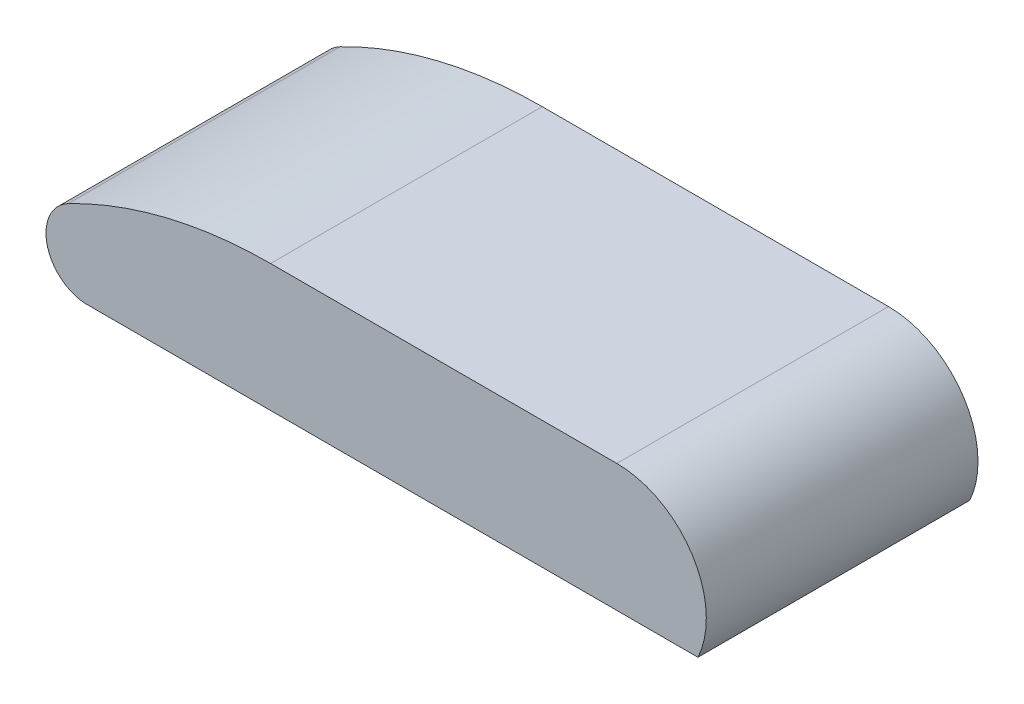
ISO-10303-21;
HEADER;
FILE_DESCRIPTION(('STEP AP214'),'2;1');
FILE_NAME('part.step','',(''),(''),'','','');
FILE_SCHEMA(('AUTOMOTIVE_DESIGN { 1 0 10303 214 1 1 1 1 }'));
ENDSEC;
DATA;
#1=APPLICATION_CONTEXT('core data for automotive mechanical design processes');
#2=APPLICATION_PROTOCOL_DEFINITION('international standard','automotive_design',2000,#1);
#3=PRODUCT_CONTEXT('',#1,'mechanical');
#4=PRODUCT('Part','Part','',(#3));
#5=PRODUCT_RELATED_PRODUCT_CATEGORY('part','',(#4));
#6=PRODUCT_DEFINITION_FORMATION('','',#4);
#7=PRODUCT_DEFINITION_CONTEXT('part definition',#1,'design');
#8=PRODUCT_DEFINITION('design','',#6,#7);
#9=PRODUCT_DEFINITION_SHAPE('','',#8);
#10=(LENGTH_UNIT() NAMED_UNIT(*) SI_UNIT(.MILLI.,.METRE.));
#11=(NAMED_UNIT(*) PLANE_ANGLE_UNIT() SI_UNIT($,.RADIAN.));
#12=(NAMED_UNIT(*) SI_UNIT($,.STERADIAN.) SOLID_ANGLE_UNIT());
#13=UNCERTAINTY_MEASURE_WITH_UNIT(LENGTH_MEASURE(1.E-05),#10,'distance_accuracy_value','');
#14=(GEOMETRIC_REPRESENTATION_CONTEXT(3) GLOBAL_UNCERTAINTY_ASSIGNED_CONTEXT((#13)) GLOBAL_UNIT_ASSIGNED_CONTEXT((#10,
#11,#12)) REPRESENTATION_CONTEXT('',''));
#15=CARTESIAN_POINT('',(0.,0.,0.));
#16=DIRECTION('',(0.,0.,1.));
#17=DIRECTION('',(1.,0.,0.));
#18=AXIS2_PLACEMENT_3D('',#15,#16,#17);
#19=CARTESIAN_POINT('',(0.,14.5,38.));
#20=DIRECTION('',(0.,-1.,0.));
#21=DIRECTION('',(1.,0.,0.));
#22=AXIS2_PLACEMENT_3D('',#19,#20,#21);
#23=PLANE('',#22);
#24=DIRECTION('',(0.,0.,-1.));
#25=VECTOR('',#24,1.);
#26=CARTESIAN_POINT('',(66.5200000000003,14.5,38.));
#27=LINE('',#26,#25);
#28=CARTESIAN_POINT('',(66.5200000000003,14.5,39.));
#29=VERTEX_POINT('',#28);
#30=CARTESIAN_POINT('',(66.5200000000003,14.5,-1.));
#31=VERTEX_POINT('',#30);
#32=EDGE_CURVE('E254',#29,#31,#27,.T.);
#33=ORIENTED_EDGE('',*,*,#32,.T.);
#34=DIRECTION('',(1.,0.,0.));
#35=VECTOR('',#34,1.);
#36=CARTESIAN_POINT('',(15.5400000000003,14.5,-1.));
#37=LINE('',#36,#35);
#38=CARTESIAN_POINT('',(15.5400000000003,14.5,-1.));
#39=VERTEX_POINT('',#38);
#40=EDGE_CURVE('E218',#39,#31,#37,.T.);
#41=ORIENTED_EDGE('',*,*,#40,.F.);
#42=DIRECTION('',(0.,0.,-1.));
#43=VECTOR('',#42,1.);
#44=CARTESIAN_POINT('',(15.5400000000003,14.5,38.));
#45=LINE('',#44,#43);
#46=CARTESIAN_POINT('',(15.5400000000003,14.5,39.));
#47=VERTEX_POINT('',#46);
#48=EDGE_CURVE('E305',#47,#39,#45,.T.);
#49=ORIENTED_EDGE('',*,*,#48,.F.);
#50=DIRECTION('',(1.,0.,0.));
#51=VECTOR('',#50,1.);
#52=CARTESIAN_POINT('',(15.5400000000003,14.5,39.));
#53=LINE('',#52,#51);
#54=EDGE_CURVE('E209',#47,#29,#53,.T.);
#55=ORIENTED_EDGE('',*,*,#54,.T.);
#56=EDGE_LOOP('',(#33,#41,#49,#55));
#57=FACE_BOUND('',#56,.T.);
#58=ADVANCED_FACE('F33',(#57),#23,.F.);
#59=CARTESIAN_POINT('',(15.5400000000003,-50.2795958789134,38.));
#60=DIRECTION('',(0.,0.,-1.));
#61=DIRECTION('',(-1.,0.,0.));
#62=AXIS2_PLACEMENT_3D('',#59,#60,#61);
#63=CYLINDRICAL_SURFACE('',#62,64.7795958789135);
#64=ORIENTED_EDGE('',*,*,#48,.T.);
#65=CARTESIAN_POINT('',(15.5400000000003,-50.2795958789134,-1.));
#66=DIRECTION('',(0.,0.,-1.));
#67=DIRECTION('',(-1.,0.,0.));
#68=AXIS2_PLACEMENT_3D('',#65,#66,#67);
#69=CIRCLE('',#68,64.7795958789135);
#70=CARTESIAN_POINT('',(-14.2250375276555,7.25681505549044,-1.));
#71=VERTEX_POINT('',#70);
#72=EDGE_CURVE('E215',#71,#39,#69,.T.);
#73=ORIENTED_EDGE('',*,*,#72,.F.);
#74=DIRECTION('',(0.,0.,-1.));
#75=VECTOR('',#74,1.);
#76=CARTESIAN_POINT('',(-14.2250375276555,7.25681505549044,38.));
#77=LINE('',#76,#75);
#78=CARTESIAN_POINT('',(-14.2250375276555,7.25681505549044,39.));
#79=VERTEX_POINT('',#78);
#80=EDGE_CURVE('E303',#79,#71,#77,.T.);
#81=ORIENTED_EDGE('',*,*,#80,.F.);
#82=CARTESIAN_POINT('',(15.5400000000003,-50.2795958789134,39.));
#83=DIRECTION('',(0.,0.,-1.));
#84=DIRECTION('',(-1.,0.,0.));
#85=AXIS2_PLACEMENT_3D('',#82,#83,#84);
#86=CIRCLE('',#85,64.7795958789135);
#87=EDGE_CURVE('E200',#79,#47,#86,.T.);
#88=ORIENTED_EDGE('',*,*,#87,.T.);
#89=EDGE_LOOP('',(#64,#73,#81,#88));
#90=FACE_BOUND('',#89,.T.);
#91=ADVANCED_FACE('F353',(#90),#63,.T.);
#92=CARTESIAN_POINT('',(-11.426599769246,1.84737907905001,38.));
#93=DIRECTION('',(0.,0.,-1.));
#94=DIRECTION('',(-1.,0.,0.));
#95=AXIS2_PLACEMENT_3D('',#92,#93,#94);
#96=CYLINDRICAL_SURFACE('',#95,6.09042293038011);
#97=ORIENTED_EDGE('',*,*,#80,.T.);
#98=CARTESIAN_POINT('',(-11.426599769246,1.84737907905001,-1.));
#99=DIRECTION('',(0.,0.,-1.));
#100=DIRECTION('',(-1.,0.,0.));
#101=AXIS2_PLACEMENT_3D('',#98,#99,#100);
#102=CIRCLE('',#101,6.09042293038011);
#103=CARTESIAN_POINT('',(-11.7115140980292,-4.23637595350628,-1.));
#104=VERTEX_POINT('',#103);
#105=EDGE_CURVE('E224',#104,#71,#102,.T.);
#106=ORIENTED_EDGE('',*,*,#105,.F.);
#107=DIRECTION('',(0.,0.,-1.));
#108=VECTOR('',#107,1.);
#109=CARTESIAN_POINT('',(-11.7115140980292,-4.23637595350628,38.));
#110=LINE('',#109,#108);
#111=CARTESIAN_POINT('',(-11.7115140980292,-4.23637595350613,39.));
#112=VERTEX_POINT('',#111);
#113=EDGE_CURVE('E300',#112,#104,#110,.T.);
#114=ORIENTED_EDGE('',*,*,#113,.F.);
#115=CARTESIAN_POINT('',(-11.426599769246,1.84737907905001,39.));
#116=DIRECTION('',(0.,0.,-1.));
#117=DIRECTION('',(-1.,0.,0.));
#118=AXIS2_PLACEMENT_3D('',#115,#116,#117);
#119=CIRCLE('',#118,6.09042293038011);
#120=EDGE_CURVE('E203',#112,#79,#119,.T.);
#121=ORIENTED_EDGE('',*,*,#120,.T.);
#122=EDGE_LOOP('',(#97,#106,#114,#121));
#123=FACE_BOUND('',#122,.T.);
#124=ADVANCED_FACE('F348',(#123),#96,.T.);
#125=CARTESIAN_POINT('',(66.5200000000003,1.31995191292337,38.));
#126=DIRECTION('',(0.,0.,-1.));
#127=DIRECTION('',(-1.,0.,0.));
#128=AXIS2_PLACEMENT_3D('',#125,#126,#127);
#129=CYLINDRICAL_SURFACE('',#128,13.1800480870766);
#130=DIRECTION('',(0.,0.,-1.));
#131=VECTOR('',#130,1.);
#132=CARTESIAN_POINT('',(78.4684108324822,-4.24324376545071,38.));
#133=LINE('',#132,#131);
#134=CARTESIAN_POINT('',(78.4684108324822,-4.2432437654507,39.));
#135=VERTEX_POINT('',#134);
#136=CARTESIAN_POINT('',(78.4684108324822,-4.2432437654507,-1.));
#137=VERTEX_POINT('',#136);
#138=EDGE_CURVE('E276',#135,#137,#133,.T.);
#139=ORIENTED_EDGE('',*,*,#138,.T.);
#140=CARTESIAN_POINT('',(66.5200000000003,1.31995191292337,-1.));
#141=DIRECTION('',(0.,0.,-1.));
#142=DIRECTION('',(-1.,0.,0.));
#143=AXIS2_PLACEMENT_3D('',#140,#141,#142);
#144=CIRCLE('',#143,13.1800480870767);
#145=EDGE_CURVE('E221',#31,#137,#144,.T.);
#146=ORIENTED_EDGE('',*,*,#145,.F.);
#147=ORIENTED_EDGE('',*,*,#32,.F.);
#148=CARTESIAN_POINT('',(66.5200000000003,1.31995191292337,39.));
#149=DIRECTION('',(0.,0.,-1.));
#150=DIRECTION('',(-1.,0.,0.));
#151=AXIS2_PLACEMENT_3D('',#148,#149,#150);
#152=CIRCLE('',#151,13.1800480870767);
#153=EDGE_CURVE('E206',#29,#135,#152,.T.);
#154=ORIENTED_EDGE('',*,*,#153,.T.);
#155=EDGE_LOOP('',(#139,#146,#147,#154));
#156=FACE_BOUND('',#155,.T.);
#157=ADVANCED_FACE('F360',(#156),#129,.T.);
#158=CARTESIAN_POINT('',(15.5400000000003,-50.2795958789134,-1.));
#159=DIRECTION('',(0.,0.,-1.));
#160=DIRECTION('',(-1.,0.,0.));
#161=AXIS2_PLACEMENT_3D('',#158,#159,#160);
#162=PLANE('',#161);
#163=ORIENTED_EDGE('',*,*,#145,.T.);
#164=DIRECTION('',(-0.999999997100073,7.61567713651417E-05,0.));
#165=VECTOR('',#164,1.);
#166=CARTESIAN_POINT('',(15.5435063449081,-4.23845160787258,-1.));
#167=LINE('',#166,#165);
#168=EDGE_CURVE('E11',#137,#104,#167,.T.);
#169=ORIENTED_EDGE('',*,*,#168,.T.);
#170=ORIENTED_EDGE('',*,*,#105,.T.);
#171=ORIENTED_EDGE('',*,*,#72,.T.);
#172=ORIENTED_EDGE('',*,*,#40,.T.);
#173=EDGE_LOOP('',(#163,#169,#170,#171,#172));
#174=FACE_BOUND('',#173,.T.);
#175=ADVANCED_FACE('F351',(#174),#162,.T.);
#176=CARTESIAN_POINT('',(15.5400000000003,-50.2795958789134,39.));
#177=DIRECTION('',(0.,0.,1.));
#178=DIRECTION('',(-1.,0.,0.));
#179=AXIS2_PLACEMENT_3D('',#176,#177,#178);
#180=PLANE('',#179);
#181=ORIENTED_EDGE('',*,*,#120,.F.);
#182=DIRECTION('',(0.999999997100073,-7.61567713651417E-05,0.));
#183=VECTOR('',#182,1.);
#184=CARTESIAN_POINT('',(15.5435063449081,-4.23845160787257,39.));
#185=LINE('',#184,#183);
#186=EDGE_CURVE('E42',#112,#135,#185,.T.);
#187=ORIENTED_EDGE('',*,*,#186,.T.);
#188=ORIENTED_EDGE('',*,*,#153,.F.);
#189=ORIENTED_EDGE('',*,*,#54,.F.);
#190=ORIENTED_EDGE('',*,*,#87,.F.);
#191=EDGE_LOOP('',(#181,#187,#188,#189,#190));
#192=FACE_BOUND('',#191,.T.);
#193=ADVANCED_FACE('F381',(#192),#180,.T.);
#194=CARTESIAN_POINT('',(-0.000322696639042186,-4.23726784003469,0.));
#195=DIRECTION('',(-7.61567713651417E-05,-0.999999997100073,0.));
#196=DIRECTION('',(0.999999997100073,-7.61567713651417E-05,0.));
#197=AXIS2_PLACEMENT_3D('',#194,#195,#196);
#198=PLANE('',#197);
#199=DIRECTION('',(0.,0.,1.));
#200=VECTOR('',#199,1.);
#201=CARTESIAN_POINT('',(64.7049797395542,-4.24219558697272,35.));
#202=LINE('',#201,#200);
#203=CARTESIAN_POINT('',(64.7049797395542,-4.24219558697272,3.));
#204=VERTEX_POINT('',#203);
#205=CARTESIAN_POINT('',(64.7049797395542,-4.24219558697272,35.));
#206=VERTEX_POINT('',#205);
#207=EDGE_CURVE('E172',#204,#206,#202,.T.);
#208=ORIENTED_EDGE('',*,*,#207,.T.);
#209=DIRECTION('',(-0.999999997100073,7.6156771365148E-05,0.));
#210=VECTOR('',#209,1.);
#211=CARTESIAN_POINT('',(64.7049797395542,-4.24219558697272,35.));
#212=LINE('',#211,#210);
#213=CARTESIAN_POINT('',(-4.71151411832865,-4.23690905090569,35.));
#214=VERTEX_POINT('',#213);
#215=EDGE_CURVE('E178',#206,#214,#212,.T.);
#216=ORIENTED_EDGE('',*,*,#215,.T.);
#217=DIRECTION('',(0.,0.,-1.));
#218=VECTOR('',#217,1.);
#219=CARTESIAN_POINT('',(-4.71151411832865,-4.23690905090569,35.));
#220=LINE('',#219,#218);
#221=CARTESIAN_POINT('',(-4.71151411832865,-4.23690905090569,2.99999999999999));
#222=VERTEX_POINT('',#221);
#223=EDGE_CURVE('E194',#214,#222,#220,.T.);
#224=ORIENTED_EDGE('',*,*,#223,.T.);
#225=DIRECTION('',(0.999999997100073,-7.6156771365148E-05,0.));
#226=VECTOR('',#225,1.);
#227=CARTESIAN_POINT('',(64.7049797395542,-4.24219558697272,3.));
#228=LINE('',#227,#226);
#229=EDGE_CURVE('E180',#222,#204,#228,.T.);
#230=ORIENTED_EDGE('',*,*,#229,.T.);
#231=EDGE_LOOP('',(#208,#216,#224,#230));
#232=FACE_BOUND('',#231,.T.);
#233=DIRECTION('',(0.,0.,-1.));
#234=VECTOR('',#233,1.);
#235=CARTESIAN_POINT('',(72.7049797163548,-4.24280484114364,38.));
#236=LINE('',#235,#234);
#237=CARTESIAN_POINT('',(72.7049797163548,-4.24280484114364,38.));
#238=VERTEX_POINT('',#237);
#239=CARTESIAN_POINT('',(72.7049797163548,-4.24280484114364,0.));
#240=VERTEX_POINT('',#239);
#241=EDGE_CURVE('E279',#238,#240,#236,.T.);
#242=ORIENTED_EDGE('',*,*,#241,.T.);
#243=DIRECTION('',(-0.999999997100073,7.61567713637186E-05,0.));
#244=VECTOR('',#243,1.);
#245=CARTESIAN_POINT('',(-6.59040304305799,-4.23676596079115,0.));
#246=LINE('',#245,#244);
#247=CARTESIAN_POINT('',(-6.59040304305799,-4.23676596079101,0.));
#248=VERTEX_POINT('',#247);
#249=EDGE_CURVE('E212',#240,#248,#246,.T.);
#250=ORIENTED_EDGE('',*,*,#249,.T.);
#251=DIRECTION('',(0.,0.,-1.));
#252=VECTOR('',#251,1.);
#253=CARTESIAN_POINT('',(-6.59040304305799,-4.23676596079115,38.));
#254=LINE('',#253,#252);
#255=CARTESIAN_POINT('',(-6.59040304305799,-4.23676596079115,38.));
#256=VERTEX_POINT('',#255);
#257=EDGE_CURVE('E297',#256,#248,#254,.T.);
#258=ORIENTED_EDGE('',*,*,#257,.F.);
#259=DIRECTION('',(-0.999999997100073,7.61567713642345E-05,0.));
#260=VECTOR('',#259,1.);
#261=CARTESIAN_POINT('',(78.4684108324822,-4.2432437654507,38.));
#262=LINE('',#261,#260);
#263=EDGE_CURVE('E199',#238,#256,#262,.T.);
#264=ORIENTED_EDGE('',*,*,#263,.F.);
#265=EDGE_LOOP('',(#242,#250,#258,#264));
#266=FACE_BOUND('',#265,.T.);
#267=ADVANCED_FACE('F174',(#232,#266),#198,.F.);
#268=CARTESIAN_POINT('',(-0.000398853410407324,-5.23726783713476,0.));
#269=DIRECTION('',(-7.61567713651417E-05,-0.999999997100073,0.));
#270=DIRECTION('',(0.999999997100073,-7.61567713651417E-05,0.));
#271=AXIS2_PLACEMENT_3D('',#268,#269,#270);
#272=PLANE('',#271);
#273=DIRECTION('',(-0.999999997100073,7.61567713651417E-05,0.));
#274=VECTOR('',#273,1.);
#275=CARTESIAN_POINT('',(-0.000398853410407574,-5.23726783713476,2.00000000000002));
#276=LINE('',#275,#274);
#277=CARTESIAN_POINT('',(65.7049035798829,-5.24227174084416,2.00000000000003));
#278=VERTEX_POINT('',#277);
#279=CARTESIAN_POINT('',(-5.71159027220006,-5.2368328912344,2.00000000000002));
#280=VERTEX_POINT('',#279);
#281=EDGE_CURVE('E50',#278,#280,#276,.T.);
#282=ORIENTED_EDGE('',*,*,#281,.T.);
#283=DIRECTION('',(0.,0.,1.));
#284=VECTOR('',#283,1.);
#285=CARTESIAN_POINT('',(-5.71159027220006,-5.2368328912344,0.));
#286=LINE('',#285,#284);
#287=CARTESIAN_POINT('',(-5.71159027220006,-5.2368328912344,36.));
#288=VERTEX_POINT('',#287);
#289=EDGE_CURVE('E320',#280,#288,#286,.T.);
#290=ORIENTED_EDGE('',*,*,#289,.T.);
#291=DIRECTION('',(0.999999997100073,-7.61567713651417E-05,0.));
#292=VECTOR('',#291,1.);
#293=CARTESIAN_POINT('',(-0.000398853410410923,-5.23726783713476,36.));
#294=LINE('',#293,#292);
#295=CARTESIAN_POINT('',(65.7049035798829,-5.24227174084416,36.));
#296=VERTEX_POINT('',#295);
#297=EDGE_CURVE('E317',#288,#296,#294,.T.);
#298=ORIENTED_EDGE('',*,*,#297,.T.);
#299=DIRECTION('',(0.,0.,-1.));
#300=VECTOR('',#299,1.);
#301=CARTESIAN_POINT('',(65.7049035798829,-5.24227174084416,0.));
#302=LINE('',#301,#300);
#303=EDGE_CURVE('E189',#296,#278,#302,.T.);
#304=ORIENTED_EDGE('',*,*,#303,.T.);
#305=EDGE_LOOP('',(#282,#290,#298,#304));
#306=FACE_BOUND('',#305,.T.);
#307=DIRECTION('',(0.999999997100073,-7.61567713651417E-05,0.));
#308=VECTOR('',#307,1.);
#309=CARTESIAN_POINT('',(-0.000398853410407324,-5.23726783713476,0.));
#310=LINE('',#309,#308);
#311=CARTESIAN_POINT('',(-10.7115902577005,-5.23645210737757,0.));
#312=VERTEX_POINT('',#311);
#313=CARTESIAN_POINT('',(77.4683346786108,-5.24316760577941,0.));
#314=VERTEX_POINT('',#313);
#315=EDGE_CURVE('E309',#312,#314,#310,.T.);
#316=ORIENTED_EDGE('',*,*,#315,.T.);
#317=DIRECTION('',(0.,0.,1.));
#318=VECTOR('',#317,1.);
#319=CARTESIAN_POINT('',(77.4683346786108,-5.24316760577941,39.));
#320=LINE('',#319,#318);
#321=CARTESIAN_POINT('',(77.4683346786108,-5.24316760577941,38.));
#322=VERTEX_POINT('',#321);
#323=EDGE_CURVE('E313',#314,#322,#320,.T.);
#324=ORIENTED_EDGE('',*,*,#323,.T.);
#325=DIRECTION('',(-0.999999997100073,7.61567713651417E-05,0.));
#326=VECTOR('',#325,1.);
#327=CARTESIAN_POINT('',(-0.000398853410407324,-5.23726783713476,38.));
#328=LINE('',#327,#326);
#329=CARTESIAN_POINT('',(-10.7115902577005,-5.23645210737757,38.));
#330=VERTEX_POINT('',#329);
#331=EDGE_CURVE('E311',#322,#330,#328,.T.);
#332=ORIENTED_EDGE('',*,*,#331,.T.);
#333=DIRECTION('',(0.,0.,-1.));
#334=VECTOR('',#333,1.);
#335=CARTESIAN_POINT('',(-10.7115902577005,-5.23645210737757,-1.));
#336=LINE('',#335,#334);
#337=EDGE_CURVE('E307',#330,#312,#336,.T.);
#338=ORIENTED_EDGE('',*,*,#337,.T.);
#339=EDGE_LOOP('',(#316,#324,#332,#338));
#340=FACE_BOUND('',#339,.T.);
#341=ADVANCED_FACE('F369',(#306,#340),#272,.T.);
#342=CARTESIAN_POINT('',(-0.000246539867672124,-3.23726784293473,38.));
#343=DIRECTION('',(-7.6156771363619E-05,-0.999999997100073,0.));
#344=DIRECTION('',(0.999999997100073,-7.6156771363619E-05,0.));
#345=AXIS2_PLACEMENT_3D('',#342,#343,#344);
#346=PLANE('',#345);
#347=DIRECTION('',(-0.999999997100073,7.6156771363619E-05,0.));
#348=VECTOR('',#347,1.);
#349=CARTESIAN_POINT('',(-0.000246539867672124,-3.23726784293473,0.));
#350=LINE('',#349,#348);
#351=CARTESIAN_POINT('',(77.8129744611661,-3.24319384663276,0.));
#352=VERTEX_POINT('',#351);
#353=CARTESIAN_POINT('',(72.7050558731262,-3.24280484404358,0.));
#354=VERTEX_POINT('',#353);
#355=EDGE_CURVE('E271',#352,#354,#350,.T.);
#356=ORIENTED_EDGE('',*,*,#355,.T.);
#357=DIRECTION('',(0.,0.,-1.));
#358=VECTOR('',#357,1.);
#359=CARTESIAN_POINT('',(72.7050558731262,-3.24280484404358,38.));
#360=LINE('',#359,#358);
#361=CARTESIAN_POINT('',(72.7050558731262,-3.24280484404358,38.));
#362=VERTEX_POINT('',#361);
#363=EDGE_CURVE('E281',#362,#354,#360,.T.);
#364=ORIENTED_EDGE('',*,*,#363,.F.);
#365=DIRECTION('',(-0.999999997100073,7.6156771363619E-05,0.));
#366=VECTOR('',#365,1.);
#367=CARTESIAN_POINT('',(-0.000246539867672124,-3.23726784293473,38.));
#368=LINE('',#367,#366);
#369=CARTESIAN_POINT('',(77.8129744611661,-3.24319384663276,38.));
#370=VERTEX_POINT('',#369);
#371=EDGE_CURVE('E248',#370,#362,#368,.T.);
#372=ORIENTED_EDGE('',*,*,#371,.F.);
#373=DIRECTION('',(0.,0.,-1.));
#374=VECTOR('',#373,1.);
#375=CARTESIAN_POINT('',(77.8129744611661,-3.24319384663276,38.));
#376=LINE('',#375,#374);
#377=EDGE_CURVE('E284',#370,#352,#376,.T.);
#378=ORIENTED_EDGE('',*,*,#377,.T.);
#379=EDGE_LOOP('',(#356,#364,#372,#378));
#380=FACE_BOUND('',#379,.T.);
#381=ADVANCED_FACE('F371',(#380),#346,.F.);
#382=CARTESIAN_POINT('',(66.5200000000003,1.31995191292337,38.));
#383=DIRECTION('',(0.,0.,-1.));
#384=DIRECTION('',(-1.,0.,0.));
#385=AXIS2_PLACEMENT_3D('',#382,#383,#384);
#386=CYLINDRICAL_SURFACE('',#385,12.1800480870767);
#387=CARTESIAN_POINT('',(66.5200000000003,1.31995191292337,0.));
#388=DIRECTION('',(0.,0.,1.));
#389=DIRECTION('',(1.,0.,0.));
#390=AXIS2_PLACEMENT_3D('',#387,#388,#389);
#391=CIRCLE('',#390,12.1800480870767);
#392=CARTESIAN_POINT('',(66.5200000000003,13.5,0.));
#393=VERTEX_POINT('',#392);
#394=EDGE_CURVE('E269',#393,#352,#391,.F.);
#395=ORIENTED_EDGE('',*,*,#394,.T.);
#396=ORIENTED_EDGE('',*,*,#377,.F.);
#397=CARTESIAN_POINT('',(66.5200000000003,1.31995191292337,38.));
#398=DIRECTION('',(0.,0.,1.));
#399=DIRECTION('',(1.,0.,0.));
#400=AXIS2_PLACEMENT_3D('',#397,#398,#399);
#401=CIRCLE('',#400,12.1800480870767);
#402=CARTESIAN_POINT('',(66.5200000000003,13.5,38.));
#403=VERTEX_POINT('',#402);
#404=EDGE_CURVE('E245',#403,#370,#401,.F.);
#405=ORIENTED_EDGE('',*,*,#404,.F.);
#406=DIRECTION('',(0.,0.,-1.));
#407=VECTOR('',#406,1.);
#408=CARTESIAN_POINT('',(66.5200000000003,13.5,38.));
#409=LINE('',#408,#407);
#410=EDGE_CURVE('E287',#403,#393,#409,.T.);
#411=ORIENTED_EDGE('',*,*,#410,.T.);
#412=EDGE_LOOP('',(#395,#396,#405,#411));
#413=FACE_BOUND('',#412,.T.);
#414=ADVANCED_FACE('F378',(#413),#386,.F.);
#415=CARTESIAN_POINT('',(0.,13.5,38.));
#416=DIRECTION('',(0.,-1.,0.));
#417=DIRECTION('',(0.,0.,-1.));
#418=AXIS2_PLACEMENT_3D('',#415,#416,#417);
#419=PLANE('',#418);
#420=DIRECTION('',(-1.,0.,0.));
#421=VECTOR('',#420,1.);
#422=CARTESIAN_POINT('',(0.,13.5,0.));
#423=LINE('',#422,#421);
#424=CARTESIAN_POINT('',(15.5400000000003,13.5,0.));
#425=VERTEX_POINT('',#424);
#426=EDGE_CURVE('E266',#393,#425,#423,.T.);
#427=ORIENTED_EDGE('',*,*,#426,.F.);
#428=ORIENTED_EDGE('',*,*,#410,.F.);
#429=DIRECTION('',(-1.,0.,0.));
#430=VECTOR('',#429,1.);
#431=CARTESIAN_POINT('',(0.,13.5,38.));
#432=LINE('',#431,#430);
#433=CARTESIAN_POINT('',(15.5400000000003,13.5,38.));
#434=VERTEX_POINT('',#433);
#435=EDGE_CURVE('E242',#403,#434,#432,.T.);
#436=ORIENTED_EDGE('',*,*,#435,.T.);
#437=DIRECTION('',(0.,0.,-1.));
#438=VECTOR('',#437,1.);
#439=CARTESIAN_POINT('',(15.5400000000003,13.5,38.));
#440=LINE('',#439,#438);
#441=EDGE_CURVE('E289',#434,#425,#440,.T.);
#442=ORIENTED_EDGE('',*,*,#441,.T.);
#443=EDGE_LOOP('',(#427,#428,#436,#442));
#444=FACE_BOUND('',#443,.T.);
#445=ADVANCED_FACE('F516',(#444),#419,.T.);
#446=CARTESIAN_POINT('',(15.5400000000003,-50.2795958789134,38.));
#447=DIRECTION('',(0.,0.,-1.));
#448=DIRECTION('',(-1.,0.,0.));
#449=AXIS2_PLACEMENT_3D('',#446,#447,#448);
#450=CYLINDRICAL_SURFACE('',#449,63.7795958789135);
#451=CARTESIAN_POINT('',(15.5400000000003,-50.2795958789134,0.));
#452=DIRECTION('',(0.,0.,1.));
#453=DIRECTION('',(1.,0.,0.));
#454=AXIS2_PLACEMENT_3D('',#451,#452,#453);
#455=CIRCLE('',#454,63.7795958789135);
#456=CARTESIAN_POINT('',(-13.7655558479103,6.36862780835242,0.));
#457=VERTEX_POINT('',#456);
#458=EDGE_CURVE('E263',#425,#457,#455,.T.);
#459=ORIENTED_EDGE('',*,*,#458,.F.);
#460=ORIENTED_EDGE('',*,*,#441,.F.);
#461=CARTESIAN_POINT('',(15.5400000000003,-50.2795958789134,38.));
#462=DIRECTION('',(0.,0.,1.));
#463=DIRECTION('',(1.,0.,0.));
#464=AXIS2_PLACEMENT_3D('',#461,#462,#463);
#465=CIRCLE('',#464,63.7795958789135);
#466=CARTESIAN_POINT('',(-13.7655558479103,6.36862780835242,38.));
#467=VERTEX_POINT('',#466);
#468=EDGE_CURVE('E239',#434,#467,#465,.T.);
#469=ORIENTED_EDGE('',*,*,#468,.T.);
#470=DIRECTION('',(0.,0.,-1.));
#471=VECTOR('',#470,1.);
#472=CARTESIAN_POINT('',(-13.7655558479103,6.36862780835242,38.));
#473=LINE('',#472,#471);
#474=EDGE_CURVE('E291',#467,#457,#473,.T.);
#475=ORIENTED_EDGE('',*,*,#474,.T.);
#476=EDGE_LOOP('',(#459,#460,#469,#475));
#477=FACE_BOUND('',#476,.T.);
#478=ADVANCED_FACE('F526',(#477),#450,.F.);
#479=CARTESIAN_POINT('',(-11.426599769246,1.84737907905001,38.));
#480=DIRECTION('',(0.,0.,-1.));
#481=DIRECTION('',(-1.,0.,0.));
#482=AXIS2_PLACEMENT_3D('',#479,#480,#481);
#483=CYLINDRICAL_SURFACE('',#482,5.09042293038011);
#484=CARTESIAN_POINT('',(-11.426599769246,1.84737907905001,0.));
#485=DIRECTION('',(0.,0.,1.));
#486=DIRECTION('',(1.,0.,0.));
#487=AXIS2_PLACEMENT_3D('',#484,#485,#486);
#488=CIRCLE('',#487,5.09042293038011);
#489=CARTESIAN_POINT('',(-11.6870252792904,-3.23637781559573,0.));
#490=VERTEX_POINT('',#489);
#491=EDGE_CURVE('E260',#457,#490,#488,.T.);
#492=ORIENTED_EDGE('',*,*,#491,.F.);
#493=ORIENTED_EDGE('',*,*,#474,.F.);
#494=CARTESIAN_POINT('',(-11.426599769246,1.84737907905001,38.));
#495=DIRECTION('',(0.,0.,1.));
#496=DIRECTION('',(1.,0.,0.));
#497=AXIS2_PLACEMENT_3D('',#494,#495,#496);
#498=CIRCLE('',#497,5.09042293038011);
#499=CARTESIAN_POINT('',(-11.6870252792904,-3.23637781559573,38.));
#500=VERTEX_POINT('',#499);
#501=EDGE_CURVE('E236',#467,#500,#498,.T.);
#502=ORIENTED_EDGE('',*,*,#501,.T.);
#503=DIRECTION('',(0.,0.,-1.));
#504=VECTOR('',#503,1.);
#505=CARTESIAN_POINT('',(-11.6870252792904,-3.23637781559573,38.));
#506=LINE('',#505,#504);
#507=EDGE_CURVE('E293',#500,#490,#506,.T.);
#508=ORIENTED_EDGE('',*,*,#507,.T.);
#509=EDGE_LOOP('',(#492,#493,#502,#508));
#510=FACE_BOUND('',#509,.T.);
#511=ADVANCED_FACE('F536',(#510),#483,.F.);
#512=CARTESIAN_POINT('',(-0.000246539867671432,-3.23726784293474,38.));
#513=DIRECTION('',(7.61567713634051E-05,0.999999997100073,0.));
#514=DIRECTION('',(-0.999999997100073,7.61567713634051E-05,0.));
#515=AXIS2_PLACEMENT_3D('',#512,#513,#514);
#516=PLANE('',#515);
#517=DIRECTION('',(0.999999997100073,-7.61567713634051E-05,0.));
#518=VECTOR('',#517,1.);
#519=CARTESIAN_POINT('',(-0.000246539867671432,-3.23726784293474,0.));
#520=LINE('',#519,#518);
#521=CARTESIAN_POINT('',(-6.59032688628663,-3.23676596369108,0.));
#522=VERTEX_POINT('',#521);
#523=EDGE_CURVE('E257',#490,#522,#520,.T.);
#524=ORIENTED_EDGE('',*,*,#523,.F.);
#525=ORIENTED_EDGE('',*,*,#507,.F.);
#526=DIRECTION('',(0.999999997100073,-7.61567713634051E-05,0.));
#527=VECTOR('',#526,1.);
#528=CARTESIAN_POINT('',(-0.000246539867671432,-3.23726784293474,38.));
#529=LINE('',#528,#527);
#530=CARTESIAN_POINT('',(-6.59032688628663,-3.23676596369108,38.));
#531=VERTEX_POINT('',#530);
#532=EDGE_CURVE('E232',#500,#531,#529,.T.);
#533=ORIENTED_EDGE('',*,*,#532,.T.);
#534=DIRECTION('',(0.,0.,-1.));
#535=VECTOR('',#534,1.);
#536=CARTESIAN_POINT('',(-6.59032688628663,-3.23676596369108,38.));
#537=LINE('',#536,#535);
#538=EDGE_CURVE('E295',#531,#522,#537,.T.);
#539=ORIENTED_EDGE('',*,*,#538,.T.);
#540=EDGE_LOOP('',(#524,#525,#533,#539));
#541=FACE_BOUND('',#540,.T.);
#542=ADVANCED_FACE('F501',(#541),#516,.T.);
#543=CARTESIAN_POINT('',(15.5400000000003,-50.2795958789134,38.));
#544=DIRECTION('',(0.,0.,1.));
#545=DIRECTION('',(-1.,0.,0.));
#546=AXIS2_PLACEMENT_3D('',#543,#544,#545);
#547=PLANE('',#546);
#548=DIRECTION('',(-7.61567713562088E-05,-0.999999997100073,0.));
#549=VECTOR('',#548,1.);
#550=CARTESIAN_POINT('',(-6.59008034641899,0.000501879243616689,38.));
#551=LINE('',#550,#549);
#552=EDGE_CURVE('E229',#531,#256,#551,.T.);
#553=ORIENTED_EDGE('',*,*,#552,.F.);
#554=ORIENTED_EDGE('',*,*,#532,.F.);
#555=ORIENTED_EDGE('',*,*,#501,.F.);
#556=ORIENTED_EDGE('',*,*,#468,.F.);
#557=ORIENTED_EDGE('',*,*,#435,.F.);
#558=ORIENTED_EDGE('',*,*,#404,.T.);
#559=ORIENTED_EDGE('',*,*,#371,.T.);
#560=DIRECTION('',(-7.61567713614136E-05,-0.999999997100073,0.));
#561=VECTOR('',#560,1.);
#562=CARTESIAN_POINT('',(72.7053024129938,-0.00553700110868571,38.));
#563=LINE('',#562,#561);
#564=EDGE_CURVE('E251',#362,#238,#563,.T.);
#565=ORIENTED_EDGE('',*,*,#564,.T.);
#566=ORIENTED_EDGE('',*,*,#263,.T.);
#567=EDGE_LOOP('',(#553,#554,#555,#556,#557,#558,#559,#565,#566));
#568=FACE_BOUND('',#567,.T.);
#569=ADVANCED_FACE('F494',(#568),#547,.F.);
#570=CARTESIAN_POINT('',(15.5400000000003,-50.2795958789134,0.));
#571=DIRECTION('',(0.,0.,-1.));
#572=DIRECTION('',(-1.,0.,0.));
#573=AXIS2_PLACEMENT_3D('',#570,#571,#572);
#574=PLANE('',#573);
#575=DIRECTION('',(-7.61567713614136E-05,-0.999999997100073,0.));
#576=VECTOR('',#575,1.);
#577=CARTESIAN_POINT('',(72.7053024129938,-0.00553700110868571,0.));
#578=LINE('',#577,#576);
#579=EDGE_CURVE('E233',#354,#240,#578,.T.);
#580=ORIENTED_EDGE('',*,*,#579,.F.);
#581=ORIENTED_EDGE('',*,*,#355,.F.);
#582=ORIENTED_EDGE('',*,*,#394,.F.);
#583=ORIENTED_EDGE('',*,*,#426,.T.);
#584=ORIENTED_EDGE('',*,*,#458,.T.);
#585=ORIENTED_EDGE('',*,*,#491,.T.);
#586=ORIENTED_EDGE('',*,*,#523,.T.);
#587=DIRECTION('',(-7.61567713562088E-05,-0.999999997100073,0.));
#588=VECTOR('',#587,1.);
#589=CARTESIAN_POINT('',(-6.59008034641899,0.000501879243616689,0.));
#590=LINE('',#589,#588);
#591=EDGE_CURVE('E227',#522,#248,#590,.T.);
#592=ORIENTED_EDGE('',*,*,#591,.T.);
#593=ORIENTED_EDGE('',*,*,#249,.F.);
#594=EDGE_LOOP('',(#580,#581,#582,#583,#584,#585,#586,#592,#593));
#595=FACE_BOUND('',#594,.T.);
#596=ADVANCED_FACE('F487',(#595),#574,.F.);
#597=CARTESIAN_POINT('',(72.7053024129938,-0.00553700110868571,38.));
#598=DIRECTION('',(0.999999997100073,-7.61567713614137E-05,0.));
#599=DIRECTION('',(7.61567713614137E-05,0.999999997100073,0.));
#600=AXIS2_PLACEMENT_3D('',#597,#598,#599);
#601=PLANE('',#600);
#602=ORIENTED_EDGE('',*,*,#579,.T.);
#603=ORIENTED_EDGE('',*,*,#241,.F.);
#604=ORIENTED_EDGE('',*,*,#564,.F.);
#605=ORIENTED_EDGE('',*,*,#363,.T.);
#606=EDGE_LOOP('',(#602,#603,#604,#605));
#607=FACE_BOUND('',#606,.T.);
#608=ADVANCED_FACE('F479',(#607),#601,.F.);
#609=CARTESIAN_POINT('',(-6.59008034641899,0.000501879243616689,38.));
#610=DIRECTION('',(0.999999997100073,-7.61567713562088E-05,0.));
#611=DIRECTION('',(7.61567713562088E-05,0.999999997100073,0.));
#612=AXIS2_PLACEMENT_3D('',#609,#610,#611);
#613=PLANE('',#612);
#614=ORIENTED_EDGE('',*,*,#591,.F.);
#615=ORIENTED_EDGE('',*,*,#538,.F.);
#616=ORIENTED_EDGE('',*,*,#552,.T.);
#617=ORIENTED_EDGE('',*,*,#257,.T.);
#618=EDGE_LOOP('',(#614,#615,#616,#617));
#619=FACE_BOUND('',#618,.T.);
#620=ADVANCED_FACE('F401',(#619),#613,.T.);
#621=CARTESIAN_POINT('',(64.7049797395542,-4.24219558697276,35.));
#622=DIRECTION('',(0.707160630105452,0.707052928166527,0.));
#623=DIRECTION('',(0.,0.,1.));
#624=AXIS2_PLACEMENT_3D('',#621,#622,#623);
#625=PLANE('',#624);
#626=DIRECTION('',(0.577306298382906,-0.577394236647798,-0.577350269189626));
#627=VECTOR('',#626,1.);
#628=CARTESIAN_POINT('',(64.7049797395542,-4.24219558697276,3.));
#629=LINE('',#628,#627);
#630=EDGE_CURVE('E191',#278,#204,#629,.F.);
#631=ORIENTED_EDGE('',*,*,#630,.F.);
#632=ORIENTED_EDGE('',*,*,#303,.F.);
#633=DIRECTION('',(-0.577306298382905,0.577394236647798,-0.577350269189627));
#634=VECTOR('',#633,1.);
#635=CARTESIAN_POINT('',(64.7049797395542,-4.24219558697276,35.));
#636=LINE('',#635,#634);
#637=EDGE_CURVE('E184',#206,#296,#636,.F.);
#638=ORIENTED_EDGE('',*,*,#637,.F.);
#639=ORIENTED_EDGE('',*,*,#207,.F.);
#640=EDGE_LOOP('',(#631,#632,#638,#639));
#641=FACE_BOUND('',#640,.T.);
#642=ADVANCED_FACE('F188',(#641),#625,.F.);
#643=CARTESIAN_POINT('',(64.7049797395542,-4.24219558697276,35.));
#644=DIRECTION('',(5.38509694654947E-05,0.707106779135992,0.707106781186545));
#645=DIRECTION('',(-0.999999997100073,7.61567713651417E-05,0.));
#646=AXIS2_PLACEMENT_3D('',#643,#644,#645);
#647=PLANE('',#646);
#648=ORIENTED_EDGE('',*,*,#637,.T.);
#649=ORIENTED_EDGE('',*,*,#297,.F.);
#650=DIRECTION('',(0.5773942366478,0.577306298382902,-0.577350269189628));
#651=VECTOR('',#650,1.);
#652=CARTESIAN_POINT('',(-4.71151411832865,-4.23690905090572,35.));
#653=LINE('',#652,#651);
#654=EDGE_CURVE('E57',#214,#288,#653,.F.);
#655=ORIENTED_EDGE('',*,*,#654,.F.);
#656=ORIENTED_EDGE('',*,*,#215,.F.);
#657=EDGE_LOOP('',(#648,#649,#655,#656));
#658=FACE_BOUND('',#657,.T.);
#659=ADVANCED_FACE('F193',(#658),#647,.F.);
#660=CARTESIAN_POINT('',(64.7049797395542,-4.24219558697276,3.));
#661=DIRECTION('',(5.38509694656536E-05,0.707106779135991,-0.707106781186546));
#662=DIRECTION('',(0.999999997100073,-7.61567713651417E-05,0.));
#663=AXIS2_PLACEMENT_3D('',#660,#661,#662);
#664=PLANE('',#663);
#665=ORIENTED_EDGE('',*,*,#630,.T.);
#666=ORIENTED_EDGE('',*,*,#229,.F.);
#667=DIRECTION('',(-0.577394236647801,-0.577306298382903,-0.577350269189627));
#668=VECTOR('',#667,1.);
#669=CARTESIAN_POINT('',(5.95596485630005,6.42894524593382,13.6666666666667));
#670=LINE('',#669,#668);
#671=EDGE_CURVE('E323',#280,#222,#670,.F.);
#672=ORIENTED_EDGE('',*,*,#671,.F.);
#673=ORIENTED_EDGE('',*,*,#281,.F.);
#674=EDGE_LOOP('',(#665,#666,#672,#673));
#675=FACE_BOUND('',#674,.T.);
#676=ADVANCED_FACE('F394',(#675),#664,.F.);
#677=CARTESIAN_POINT('',(-4.71151411832865,-4.23690905090572,35.));
#678=DIRECTION('',(-0.707052928166523,0.707160630105456,0.));
#679=DIRECTION('',(0.,0.,-1.));
#680=AXIS2_PLACEMENT_3D('',#677,#678,#679);
#681=PLANE('',#680);
#682=ORIENTED_EDGE('',*,*,#654,.T.);
#683=ORIENTED_EDGE('',*,*,#289,.F.);
#684=ORIENTED_EDGE('',*,*,#671,.T.);
#685=ORIENTED_EDGE('',*,*,#223,.F.);
#686=EDGE_LOOP('',(#682,#683,#684,#685));
#687=FACE_BOUND('',#686,.T.);
#688=ADVANCED_FACE('F391',(#687),#681,.F.);
#689=CARTESIAN_POINT('',(-10.7115902577005,-5.23645210737757,0.));
#690=DIRECTION('',(-0.707160630105457,-0.707052928166522,0.));
#691=DIRECTION('',(0.,0.,1.));
#692=AXIS2_PLACEMENT_3D('',#689,#690,#691);
#693=PLANE('',#692);
#694=DIRECTION('',(0.577306298382905,-0.577394236647804,-0.577350269189622));
#695=VECTOR('',#694,1.);
#696=CARTESIAN_POINT('',(1.95411171979644,-17.9040833897491,25.3333333333335));
#697=LINE('',#696,#695);
#698=EDGE_CURVE('E330',#112,#330,#697,.T.);
#699=ORIENTED_EDGE('',*,*,#698,.F.);
#700=ORIENTED_EDGE('',*,*,#113,.T.);
#701=DIRECTION('',(-0.577306298382905,0.577394236647804,-0.577350269189622));
#702=VECTOR('',#701,1.);
#703=CARTESIAN_POINT('',(-10.7115902577005,-5.23645210737757,0.));
#704=LINE('',#703,#702);
#705=EDGE_CURVE('E37',#312,#104,#704,.T.);
#706=ORIENTED_EDGE('',*,*,#705,.F.);
#707=ORIENTED_EDGE('',*,*,#337,.F.);
#708=EDGE_LOOP('',(#699,#700,#706,#707));
#709=FACE_BOUND('',#708,.T.);
#710=ADVANCED_FACE('F35',(#709),#693,.T.);
#711=CARTESIAN_POINT('',(-0.000398853410407324,-5.23726783713476,0.));
#712=DIRECTION('',(5.38509694655648E-05,0.707106779135985,0.707106781186552));
#713=DIRECTION('',(0.999999997100073,-7.61567713651417E-05,0.));
#714=AXIS2_PLACEMENT_3D('',#711,#712,#713);
#715=PLANE('',#714);
#716=ORIENTED_EDGE('',*,*,#705,.T.);
#717=ORIENTED_EDGE('',*,*,#168,.F.);
#718=DIRECTION('',(0.577394236647797,0.577306298382909,-0.577350269189624));
#719=VECTOR('',#718,1.);
#720=CARTESIAN_POINT('',(51.6434569117225,-31.0641121935717,25.8229112522247));
#721=LINE('',#720,#719);
#722=EDGE_CURVE('E329',#314,#137,#721,.T.);
#723=ORIENTED_EDGE('',*,*,#722,.F.);
#724=ORIENTED_EDGE('',*,*,#315,.F.);
#725=EDGE_LOOP('',(#716,#717,#723,#724));
#726=FACE_BOUND('',#725,.T.);
#727=ADVANCED_FACE('F341',(#726),#715,.F.);
#728=CARTESIAN_POINT('',(-0.000398853410407324,-5.23726783713476,38.));
#729=DIRECTION('',(5.38509694655648E-05,0.707106779135985,-0.707106781186552));
#730=DIRECTION('',(-0.999999997100073,7.61567713651417E-05,0.));
#731=AXIS2_PLACEMENT_3D('',#728,#729,#730);
#732=PLANE('',#731);
#733=ORIENTED_EDGE('',*,*,#698,.T.);
#734=ORIENTED_EDGE('',*,*,#331,.F.);
#735=DIRECTION('',(-0.577394236647797,-0.577306298382909,-0.577350269189624));
#736=VECTOR('',#735,1.);
#737=CARTESIAN_POINT('',(51.6434569117225,-31.0641121935717,12.1770887477753));
#738=LINE('',#737,#736);
#739=EDGE_CURVE('E327',#135,#322,#738,.T.);
#740=ORIENTED_EDGE('',*,*,#739,.F.);
#741=ORIENTED_EDGE('',*,*,#186,.F.);
#742=EDGE_LOOP('',(#733,#734,#740,#741));
#743=FACE_BOUND('',#742,.T.);
#744=ADVANCED_FACE('F367',(#743),#732,.F.);
#745=CARTESIAN_POINT('',(77.4683346786108,-5.24316760577941,0.));
#746=DIRECTION('',(0.707052928166529,-0.70716063010545,0.));
#747=DIRECTION('',(0.,0.,-1.));
#748=AXIS2_PLACEMENT_3D('',#745,#746,#747);
#749=PLANE('',#748);
#750=ORIENTED_EDGE('',*,*,#722,.T.);
#751=ORIENTED_EDGE('',*,*,#138,.F.);
#752=ORIENTED_EDGE('',*,*,#739,.T.);
#753=ORIENTED_EDGE('',*,*,#323,.F.);
#754=EDGE_LOOP('',(#750,#751,#752,#753));
#755=FACE_BOUND('',#754,.T.);
#756=ADVANCED_FACE('F365',(#755),#749,.T.);
#757=CLOSED_SHELL('',(#58,#91,#124,#157,#175,#193,#267,#341,#381,#414,#445,#478,#511,#542,#569,
#596,#608,#620,#642,#659,#676,#688,#710,#727,#744,#756));
#758=MANIFOLD_SOLID_BREP('B2',#757);
#759=ADVANCED_BREP_SHAPE_REPRESENTATION('',(#18,#758),#14);
#760=SHAPE_DEFINITION_REPRESENTATION(#9,#759);
ENDSEC;
END-ISO-10303-21;
